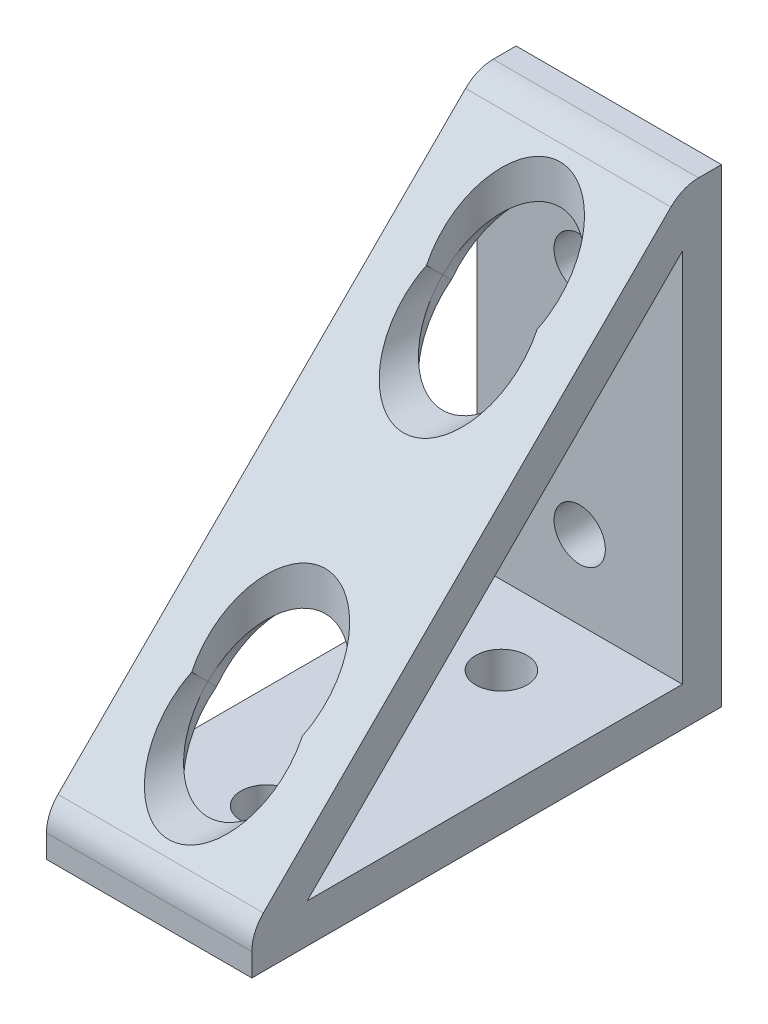
ISO-10303-21;
HEADER;
FILE_DESCRIPTION(('STEP AP214'),'2;1');
FILE_NAME('part.step','',(''),(''),'','','');
FILE_SCHEMA(('AUTOMOTIVE_DESIGN { 1 0 10303 214 1 1 1 1 }'));
ENDSEC;
DATA;
#1=APPLICATION_CONTEXT('core data for automotive mechanical design processes');
#2=APPLICATION_PROTOCOL_DEFINITION('international standard','automotive_design',2000,#1);
#3=PRODUCT_CONTEXT('',#1,'mechanical');
#4=PRODUCT('Part','Part','',(#3));
#5=PRODUCT_RELATED_PRODUCT_CATEGORY('part','',(#4));
#6=PRODUCT_DEFINITION_FORMATION('','',#4);
#7=PRODUCT_DEFINITION_CONTEXT('part definition',#1,'design');
#8=PRODUCT_DEFINITION('design','',#6,#7);
#9=PRODUCT_DEFINITION_SHAPE('','',#8);
#10=(LENGTH_UNIT() NAMED_UNIT(*) SI_UNIT(.MILLI.,.METRE.));
#11=(NAMED_UNIT(*) PLANE_ANGLE_UNIT() SI_UNIT($,.RADIAN.));
#12=(NAMED_UNIT(*) SI_UNIT($,.STERADIAN.) SOLID_ANGLE_UNIT());
#13=UNCERTAINTY_MEASURE_WITH_UNIT(LENGTH_MEASURE(1.E-05),#10,'distance_accuracy_value','');
#14=(GEOMETRIC_REPRESENTATION_CONTEXT(3) GLOBAL_UNCERTAINTY_ASSIGNED_CONTEXT((#13)) GLOBAL_UNIT_ASSIGNED_CONTEXT((#10,
#11,#12)) REPRESENTATION_CONTEXT('',''));
#15=CARTESIAN_POINT('',(0.,0.,0.));
#16=DIRECTION('',(0.,0.,1.));
#17=DIRECTION('',(1.,0.,0.));
#18=AXIS2_PLACEMENT_3D('',#15,#16,#17);
#19=CARTESIAN_POINT('',(0.,19.05,6.35));
#20=DIRECTION('',(0.,0.,1.));
#21=DIRECTION('',(0.,1.,0.));
#22=AXIS2_PLACEMENT_3D('',#19,#20,#21);
#23=CYLINDRICAL_SURFACE('',#22,9.525);
#24=CARTESIAN_POINT('',(0.,19.05,57.15));
#25=DIRECTION('',(0.,0.707106781186548,-0.707106781186548));
#26=DIRECTION('',(0.,0.707106781186548,0.707106781186548));
#27=AXIS2_PLACEMENT_3D('',#24,#25,#26);
#28=ELLIPSE('',#27,13.4703841816037,9.525);
#29=CARTESIAN_POINT('',(8.98025612106908,22.225,60.325));
#30=VERTEX_POINT('',#29);
#31=CARTESIAN_POINT('',(9.525,19.05,57.15));
#32=VERTEX_POINT('',#31);
#33=EDGE_CURVE('E321',#30,#32,#28,.T.);
#34=ORIENTED_EDGE('',*,*,#33,.T.);
#35=CARTESIAN_POINT('',(0.,19.05,57.15));
#36=DIRECTION('',(0.,-0.707106781186548,-0.707106781186548));
#37=DIRECTION('',(0.,-0.707106781186548,0.707106781186548));
#38=AXIS2_PLACEMENT_3D('',#35,#36,#37);
#39=ELLIPSE('',#38,13.4703841816037,9.525);
#40=CARTESIAN_POINT('',(-9.525,19.05,57.15));
#41=VERTEX_POINT('',#40);
#42=EDGE_CURVE('E356',#32,#41,#39,.T.);
#43=ORIENTED_EDGE('',*,*,#42,.T.);
#44=CARTESIAN_POINT('',(0.,19.05,57.15));
#45=DIRECTION('',(0.,0.707106781186548,-0.707106781186548));
#46=DIRECTION('',(0.,0.707106781186548,0.707106781186548));
#47=AXIS2_PLACEMENT_3D('',#44,#45,#46);
#48=ELLIPSE('',#47,13.4703841816037,9.525);
#49=CARTESIAN_POINT('',(-8.98025612106908,22.225,60.325));
#50=VERTEX_POINT('',#49);
#51=EDGE_CURVE('E354',#41,#50,#48,.T.);
#52=ORIENTED_EDGE('',*,*,#51,.T.);
#53=CARTESIAN_POINT('',(0.,19.05,63.5));
#54=DIRECTION('',(0.,-0.707106781186548,-0.707106781186548));
#55=DIRECTION('',(0.,-0.707106781186548,0.707106781186548));
#56=AXIS2_PLACEMENT_3D('',#53,#54,#55);
#57=ELLIPSE('',#56,13.4703841816037,9.525);
#58=EDGE_CURVE('E365',#30,#50,#57,.T.);
#59=ORIENTED_EDGE('',*,*,#58,.F.);
#60=EDGE_LOOP('',(#34,#43,#52,#59));
#61=FACE_BOUND('',#60,.T.);
#62=ADVANCED_FACE('F45',(#61),#23,.F.);
#63=CARTESIAN_POINT('',(16.6624,74.340128060535,8.2098719394654));
#64=DIRECTION('',(0.,-0.707106781186548,-0.707106781186548));
#65=DIRECTION('',(0.,0.707106781186548,-0.707106781186548));
#66=AXIS2_PLACEMENT_3D('',#63,#64,#65);
#67=PLANE('',#66);
#68=CARTESIAN_POINT('',(0.,63.5,19.05));
#69=DIRECTION('',(0.,-0.707106781186548,-0.707106781186548));
#70=DIRECTION('',(0.,0.707106781186548,-0.707106781186548));
#71=AXIS2_PLACEMENT_3D('',#68,#69,#70);
#72=ELLIPSE('',#71,13.4703841816037,9.525);
#73=CARTESIAN_POINT('',(-8.98025612106908,60.325,22.225));
#74=VERTEX_POINT('',#73);
#75=CARTESIAN_POINT('',(8.98025612106908,60.325,22.225));
#76=VERTEX_POINT('',#75);
#77=EDGE_CURVE('E466',#74,#76,#72,.T.);
#78=ORIENTED_EDGE('',*,*,#77,.T.);
#79=CARTESIAN_POINT('',(0.,57.15,25.4000000000004));
#80=DIRECTION('',(0.,-0.707106781186548,-0.707106781186548));
#81=DIRECTION('',(0.,-0.707106781186548,0.707106781186548));
#82=AXIS2_PLACEMENT_3D('',#79,#80,#81);
#83=ELLIPSE('',#82,13.4703841816037,9.525);
#84=EDGE_CURVE('E465',#76,#74,#83,.T.);
#85=ORIENTED_EDGE('',*,*,#84,.T.);
#86=EDGE_LOOP('',(#78,#85));
#87=FACE_BOUND('',#86,.T.);
#88=ORIENTED_EDGE('',*,*,#58,.T.);
#89=CARTESIAN_POINT('',(0.,25.4000000000004,57.15));
#90=DIRECTION('',(0.,-0.707106781186548,-0.707106781186548));
#91=DIRECTION('',(0.,0.707106781186548,-0.707106781186548));
#92=AXIS2_PLACEMENT_3D('',#89,#90,#91);
#93=ELLIPSE('',#92,13.4703841816037,9.525);
#94=EDGE_CURVE('E489',#50,#30,#93,.T.);
#95=ORIENTED_EDGE('',*,*,#94,.T.);
#96=EDGE_LOOP('',(#88,#95));
#97=FACE_BOUND('',#96,.T.);
#98=DIRECTION('',(0.,-0.707106781186548,0.707106781186548));
#99=VECTOR('',#98,1.);
#100=CARTESIAN_POINT('',(-16.6624,74.340128060535,8.2098719394654));
#101=LINE('',#100,#99);
#102=CARTESIAN_POINT('',(-16.6624,74.340128060535,8.2098719394654));
#103=VERTEX_POINT('',#102);
#104=CARTESIAN_POINT('',(-16.6624,8.20987193946522,74.3401280605352));
#105=VERTEX_POINT('',#104);
#106=EDGE_CURVE('E495',#103,#105,#101,.T.);
#107=ORIENTED_EDGE('',*,*,#106,.T.);
#108=DIRECTION('',(-1.,0.,0.));
#109=VECTOR('',#108,1.);
#110=CARTESIAN_POINT('',(16.6624,8.20987193946524,74.3401280605352));
#111=LINE('',#110,#109);
#112=CARTESIAN_POINT('',(16.6624,8.20987193946522,74.3401280605352));
#113=VERTEX_POINT('',#112);
#114=EDGE_CURVE('E66',#105,#113,#111,.F.);
#115=ORIENTED_EDGE('',*,*,#114,.T.);
#116=DIRECTION('',(0.,-0.707106781186548,0.707106781186548));
#117=VECTOR('',#116,1.);
#118=CARTESIAN_POINT('',(16.6624,74.340128060535,8.2098719394654));
#119=LINE('',#118,#117);
#120=CARTESIAN_POINT('',(16.6624,74.340128060535,8.2098719394654));
#121=VERTEX_POINT('',#120);
#122=EDGE_CURVE('E294',#121,#113,#119,.T.);
#123=ORIENTED_EDGE('',*,*,#122,.F.);
#124=DIRECTION('',(-1.,0.,0.));
#125=VECTOR('',#124,1.);
#126=CARTESIAN_POINT('',(16.6624,74.340128060535,8.2098719394654));
#127=LINE('',#126,#125);
#128=EDGE_CURVE('E518',#121,#103,#127,.T.);
#129=ORIENTED_EDGE('',*,*,#128,.T.);
#130=EDGE_LOOP('',(#107,#115,#123,#129));
#131=FACE_BOUND('',#130,.T.);
#132=ADVANCED_FACE('F559',(#87,#97,#131),#67,.F.);
#133=CARTESIAN_POINT('',(16.6624,3.71974387893206,69.850000000002));
#134=DIRECTION('',(1.,0.,0.));
#135=DIRECTION('',(0.,0.,-1.));
#136=AXIS2_PLACEMENT_3D('',#133,#134,#135);
#137=PLANE('',#136);
#138=DIRECTION('',(0.,0.,1.));
#139=VECTOR('',#138,1.);
#140=CARTESIAN_POINT('',(16.6624,6.35,76.2));
#141=LINE('',#140,#139);
#142=CARTESIAN_POINT('',(16.6624,6.35,6.34999999999999));
#143=VERTEX_POINT('',#142);
#144=CARTESIAN_POINT('',(16.6624,6.35,67.219743878931));
#145=VERTEX_POINT('',#144);
#146=EDGE_CURVE('E186',#143,#145,#141,.T.);
#147=ORIENTED_EDGE('',*,*,#146,.T.);
#148=DIRECTION('',(0.,-0.707106781186548,0.707106781186548));
#149=VECTOR('',#148,1.);
#150=CARTESIAN_POINT('',(16.6624,67.219743878931,6.35));
#151=LINE('',#150,#149);
#152=CARTESIAN_POINT('',(16.6624,67.219743878931,6.34999999999999));
#153=VERTEX_POINT('',#152);
#154=EDGE_CURVE('E511',#153,#145,#151,.T.);
#155=ORIENTED_EDGE('',*,*,#154,.F.);
#156=DIRECTION('',(0.,-1.,0.));
#157=VECTOR('',#156,1.);
#158=CARTESIAN_POINT('',(16.6624,6.35,6.34999999999999));
#159=LINE('',#158,#157);
#160=EDGE_CURVE('E204',#153,#143,#159,.T.);
#161=ORIENTED_EDGE('',*,*,#160,.T.);
#162=EDGE_LOOP('',(#147,#155,#161));
#163=FACE_BOUND('',#162,.T.);
#164=ORIENTED_EDGE('',*,*,#122,.T.);
#165=CARTESIAN_POINT('',(16.6624,3.71974387893206,69.850000000002));
#166=DIRECTION('',(1.,0.,0.));
#167=DIRECTION('',(0.,0.,-1.));
#168=AXIS2_PLACEMENT_3D('',#165,#166,#167);
#169=CIRCLE('',#168,6.34999999999802);
#170=CARTESIAN_POINT('',(16.6624,3.71974387893206,76.2));
#171=VERTEX_POINT('',#170);
#172=EDGE_CURVE('E53',#113,#171,#169,.T.);
#173=ORIENTED_EDGE('',*,*,#172,.T.);
#174=DIRECTION('',(0.,1.,0.));
#175=VECTOR('',#174,1.);
#176=CARTESIAN_POINT('',(16.6624,0.,76.2));
#177=LINE('',#176,#175);
#178=CARTESIAN_POINT('',(16.6624,0.,76.2));
#179=VERTEX_POINT('',#178);
#180=EDGE_CURVE('E174',#179,#171,#177,.T.);
#181=ORIENTED_EDGE('',*,*,#180,.F.);
#182=DIRECTION('',(0.,0.,1.));
#183=VECTOR('',#182,1.);
#184=CARTESIAN_POINT('',(16.6624,0.,76.2));
#185=LINE('',#184,#183);
#186=CARTESIAN_POINT('',(16.6624,0.,0.));
#187=VERTEX_POINT('',#186);
#188=EDGE_CURVE('E171',#187,#179,#185,.T.);
#189=ORIENTED_EDGE('',*,*,#188,.F.);
#190=DIRECTION('',(0.,-1.,0.));
#191=VECTOR('',#190,1.);
#192=CARTESIAN_POINT('',(16.6624,6.35,0.));
#193=LINE('',#192,#191);
#194=CARTESIAN_POINT('',(16.6624,76.2,0.));
#195=VERTEX_POINT('',#194);
#196=EDGE_CURVE('E160',#195,#187,#193,.T.);
#197=ORIENTED_EDGE('',*,*,#196,.F.);
#198=DIRECTION('',(0.,0.,1.));
#199=VECTOR('',#198,1.);
#200=CARTESIAN_POINT('',(16.6624,76.2,0.));
#201=LINE('',#200,#199);
#202=CARTESIAN_POINT('',(16.6624,76.2,3.71974387893222));
#203=VERTEX_POINT('',#202);
#204=EDGE_CURVE('E168',#195,#203,#201,.T.);
#205=ORIENTED_EDGE('',*,*,#204,.T.);
#206=CARTESIAN_POINT('',(16.6624,69.8500000000018,3.71974387893222));
#207=DIRECTION('',(1.,0.,0.));
#208=DIRECTION('',(0.,0.,-1.));
#209=AXIS2_PLACEMENT_3D('',#206,#207,#208);
#210=CIRCLE('',#209,6.34999999999802);
#211=EDGE_CURVE('E522',#203,#121,#210,.T.);
#212=ORIENTED_EDGE('',*,*,#211,.T.);
#213=EDGE_LOOP('',(#164,#173,#181,#189,#197,#205,#212));
#214=FACE_BOUND('',#213,.T.);
#215=ADVANCED_FACE('F172',(#163,#214),#137,.T.);
#216=CARTESIAN_POINT('',(16.6624,67.219743878931,6.35));
#217=DIRECTION('',(0.,-0.707106781186548,-0.707106781186548));
#218=DIRECTION('',(0.,0.707106781186548,-0.707106781186548));
#219=AXIS2_PLACEMENT_3D('',#216,#217,#218);
#220=PLANE('',#219);
#221=CARTESIAN_POINT('',(0.,16.419743878931,57.15));
#222=DIRECTION('',(0.,-0.707106781186548,-0.707106781186548));
#223=DIRECTION('',(0.,0.707106781186548,-0.707106781186548));
#224=AXIS2_PLACEMENT_3D('',#221,#222,#223);
#225=ELLIPSE('',#224,13.4703841816037,9.525);
#226=CARTESIAN_POINT('',(9.43377247893942,17.7348719394655,55.8348719394655));
#227=VERTEX_POINT('',#226);
#228=CARTESIAN_POINT('',(-9.43377247893942,17.7348719394655,55.8348719394655));
#229=VERTEX_POINT('',#228);
#230=EDGE_CURVE('E390',#227,#229,#225,.T.);
#231=ORIENTED_EDGE('',*,*,#230,.F.);
#232=CARTESIAN_POINT('',(0.,19.05,54.519743878931));
#233=DIRECTION('',(0.,-0.707106781186548,-0.707106781186548));
#234=DIRECTION('',(0.,-0.707106781186548,0.707106781186548));
#235=AXIS2_PLACEMENT_3D('',#232,#233,#234);
#236=ELLIPSE('',#235,13.4703841816037,9.525);
#237=EDGE_CURVE('E389',#229,#227,#236,.T.);
#238=ORIENTED_EDGE('',*,*,#237,.F.);
#239=EDGE_LOOP('',(#231,#238));
#240=FACE_BOUND('',#239,.T.);
#241=CARTESIAN_POINT('',(0.,57.15,16.419743878931));
#242=DIRECTION('',(0.,-0.707106781186548,-0.707106781186548));
#243=DIRECTION('',(0.,-0.707106781186548,0.707106781186548));
#244=AXIS2_PLACEMENT_3D('',#241,#242,#243);
#245=ELLIPSE('',#244,13.4703841816037,9.525);
#246=CARTESIAN_POINT('',(-9.43377247893942,55.8348719394655,17.7348719394655));
#247=VERTEX_POINT('',#246);
#248=CARTESIAN_POINT('',(9.43377247893942,55.8348719394655,17.7348719394655));
#249=VERTEX_POINT('',#248);
#250=EDGE_CURVE('E448',#247,#249,#245,.T.);
#251=ORIENTED_EDGE('',*,*,#250,.F.);
#252=CARTESIAN_POINT('',(0.,54.519743878931,19.05));
#253=DIRECTION('',(0.,-0.707106781186548,-0.707106781186548));
#254=DIRECTION('',(0.,0.707106781186548,-0.707106781186548));
#255=AXIS2_PLACEMENT_3D('',#252,#253,#254);
#256=ELLIPSE('',#255,13.4703841816037,9.525);
#257=EDGE_CURVE('E272',#249,#247,#256,.T.);
#258=ORIENTED_EDGE('',*,*,#257,.F.);
#259=EDGE_LOOP('',(#251,#258));
#260=FACE_BOUND('',#259,.T.);
#261=DIRECTION('',(0.,-0.707106781186548,0.707106781186548));
#262=VECTOR('',#261,1.);
#263=CARTESIAN_POINT('',(-16.6624,67.219743878931,6.35));
#264=LINE('',#263,#262);
#265=CARTESIAN_POINT('',(-16.6624,67.219743878931,6.34999999999999));
#266=VERTEX_POINT('',#265);
#267=CARTESIAN_POINT('',(-16.6624,6.35,67.219743878931));
#268=VERTEX_POINT('',#267);
#269=EDGE_CURVE('E270',#266,#268,#264,.T.);
#270=ORIENTED_EDGE('',*,*,#269,.F.);
#271=DIRECTION('',(-1.,0.,0.));
#272=VECTOR('',#271,1.);
#273=CARTESIAN_POINT('',(16.6624,67.219743878931,6.35));
#274=LINE('',#273,#272);
#275=EDGE_CURVE('E395',#153,#266,#274,.T.);
#276=ORIENTED_EDGE('',*,*,#275,.F.);
#277=ORIENTED_EDGE('',*,*,#154,.T.);
#278=DIRECTION('',(-1.,0.,0.));
#279=VECTOR('',#278,1.);
#280=CARTESIAN_POINT('',(16.6624,6.35,67.219743878931));
#281=LINE('',#280,#279);
#282=EDGE_CURVE('E699',#145,#268,#281,.T.);
#283=ORIENTED_EDGE('',*,*,#282,.T.);
#284=EDGE_LOOP('',(#270,#276,#277,#283));
#285=FACE_BOUND('',#284,.T.);
#286=ADVANCED_FACE('F700',(#240,#260,#285),#220,.T.);
#287=CARTESIAN_POINT('',(-16.6624,3.71974387893206,69.850000000002));
#288=DIRECTION('',(1.,0.,0.));
#289=DIRECTION('',(0.,0.,-1.));
#290=AXIS2_PLACEMENT_3D('',#287,#288,#289);
#291=PLANE('',#290);
#292=ORIENTED_EDGE('',*,*,#269,.T.);
#293=DIRECTION('',(0.,0.,-1.));
#294=VECTOR('',#293,1.);
#295=CARTESIAN_POINT('',(-16.6624,6.35,0.));
#296=LINE('',#295,#294);
#297=CARTESIAN_POINT('',(-16.6624,6.35,6.34999999999999));
#298=VERTEX_POINT('',#297);
#299=EDGE_CURVE('E183',#268,#298,#296,.T.);
#300=ORIENTED_EDGE('',*,*,#299,.T.);
#301=DIRECTION('',(0.,1.,0.));
#302=VECTOR('',#301,1.);
#303=CARTESIAN_POINT('',(-16.6624,76.2,6.34999999999999));
#304=LINE('',#303,#302);
#305=EDGE_CURVE('E209',#298,#266,#304,.T.);
#306=ORIENTED_EDGE('',*,*,#305,.T.);
#307=EDGE_LOOP('',(#292,#300,#306));
#308=FACE_BOUND('',#307,.T.);
#309=DIRECTION('',(0.,1.,0.));
#310=VECTOR('',#309,1.);
#311=CARTESIAN_POINT('',(-16.6624,0.,76.2));
#312=LINE('',#311,#310);
#313=CARTESIAN_POINT('',(-16.6624,0.,76.2));
#314=VERTEX_POINT('',#313);
#315=CARTESIAN_POINT('',(-16.6624,3.71974387893206,76.2));
#316=VERTEX_POINT('',#315);
#317=EDGE_CURVE('E194',#314,#316,#312,.T.);
#318=ORIENTED_EDGE('',*,*,#317,.T.);
#319=CARTESIAN_POINT('',(-16.6624,3.71974387893206,69.850000000002));
#320=DIRECTION('',(1.,0.,0.));
#321=DIRECTION('',(0.,0.,-1.));
#322=AXIS2_PLACEMENT_3D('',#319,#320,#321);
#323=CIRCLE('',#322,6.34999999999802);
#324=EDGE_CURVE('E517',#316,#105,#323,.F.);
#325=ORIENTED_EDGE('',*,*,#324,.T.);
#326=ORIENTED_EDGE('',*,*,#106,.F.);
#327=CARTESIAN_POINT('',(-16.6624,69.8500000000018,3.71974387893222));
#328=DIRECTION('',(1.,0.,0.));
#329=DIRECTION('',(0.,0.,-1.));
#330=AXIS2_PLACEMENT_3D('',#327,#328,#329);
#331=CIRCLE('',#330,6.34999999999802);
#332=CARTESIAN_POINT('',(-16.6624,76.2,3.71974387893222));
#333=VERTEX_POINT('',#332);
#334=EDGE_CURVE('E516',#103,#333,#331,.F.);
#335=ORIENTED_EDGE('',*,*,#334,.T.);
#336=DIRECTION('',(0.,0.,1.));
#337=VECTOR('',#336,1.);
#338=CARTESIAN_POINT('',(-16.6624,76.2,0.));
#339=LINE('',#338,#337);
#340=CARTESIAN_POINT('',(-16.6624,76.2,0.));
#341=VERTEX_POINT('',#340);
#342=EDGE_CURVE('E222',#341,#333,#339,.T.);
#343=ORIENTED_EDGE('',*,*,#342,.F.);
#344=DIRECTION('',(0.,1.,0.));
#345=VECTOR('',#344,1.);
#346=CARTESIAN_POINT('',(-16.6624,76.2,0.));
#347=LINE('',#346,#345);
#348=CARTESIAN_POINT('',(-16.6624,0.,0.));
#349=VERTEX_POINT('',#348);
#350=EDGE_CURVE('E202',#349,#341,#347,.T.);
#351=ORIENTED_EDGE('',*,*,#350,.F.);
#352=DIRECTION('',(0.,0.,-1.));
#353=VECTOR('',#352,1.);
#354=CARTESIAN_POINT('',(-16.6624,0.,0.));
#355=LINE('',#354,#353);
#356=EDGE_CURVE('E182',#314,#349,#355,.T.);
#357=ORIENTED_EDGE('',*,*,#356,.F.);
#358=EDGE_LOOP('',(#318,#325,#326,#335,#343,#351,#357));
#359=FACE_BOUND('',#358,.T.);
#360=ADVANCED_FACE('F735',(#308,#359),#291,.F.);
#361=CARTESIAN_POINT('',(0.,6.35,19.05));
#362=DIRECTION('',(0.,1.,0.));
#363=DIRECTION('',(0.,0.,-1.));
#364=AXIS2_PLACEMENT_3D('',#361,#362,#363);
#365=CYLINDRICAL_SURFACE('',#364,9.525);
#366=CARTESIAN_POINT('',(0.,57.15,19.05));
#367=DIRECTION('',(0.,0.707106781186548,-0.707106781186548));
#368=DIRECTION('',(0.,0.707106781186548,0.707106781186548));
#369=AXIS2_PLACEMENT_3D('',#366,#367,#368);
#370=ELLIPSE('',#369,13.4703841816037,9.525);
#371=CARTESIAN_POINT('',(-9.525,57.15,19.05));
#372=VERTEX_POINT('',#371);
#373=EDGE_CURVE('E418',#247,#372,#370,.T.);
#374=ORIENTED_EDGE('',*,*,#373,.T.);
#375=CARTESIAN_POINT('',(0.,57.15,19.05));
#376=DIRECTION('',(0.,0.707106781186548,0.707106781186548));
#377=DIRECTION('',(0.,0.707106781186548,-0.707106781186548));
#378=AXIS2_PLACEMENT_3D('',#375,#376,#377);
#379=ELLIPSE('',#378,13.4703841816037,9.525);
#380=CARTESIAN_POINT('',(9.525,57.15,19.05));
#381=VERTEX_POINT('',#380);
#382=EDGE_CURVE('E440',#372,#381,#379,.T.);
#383=ORIENTED_EDGE('',*,*,#382,.T.);
#384=CARTESIAN_POINT('',(0.,57.15,19.05));
#385=DIRECTION('',(0.,0.707106781186548,-0.707106781186548));
#386=DIRECTION('',(0.,0.707106781186548,0.707106781186548));
#387=AXIS2_PLACEMENT_3D('',#384,#385,#386);
#388=ELLIPSE('',#387,13.4703841816037,9.525);
#389=EDGE_CURVE('E439',#381,#249,#388,.T.);
#390=ORIENTED_EDGE('',*,*,#389,.T.);
#391=ORIENTED_EDGE('',*,*,#257,.T.);
#392=EDGE_LOOP('',(#374,#383,#390,#391));
#393=FACE_BOUND('',#392,.T.);
#394=ADVANCED_FACE('F737',(#393),#365,.F.);
#395=CARTESIAN_POINT('',(0.,57.15,6.35));
#396=DIRECTION('',(0.,0.,1.));
#397=DIRECTION('',(0.,-1.,0.));
#398=AXIS2_PLACEMENT_3D('',#395,#396,#397);
#399=CYLINDRICAL_SURFACE('',#398,9.525);
#400=ORIENTED_EDGE('',*,*,#373,.F.);
#401=ORIENTED_EDGE('',*,*,#250,.T.);
#402=ORIENTED_EDGE('',*,*,#389,.F.);
#403=CARTESIAN_POINT('',(0.,57.15,19.05));
#404=DIRECTION('',(0.,-0.707106781186548,-0.707106781186548));
#405=DIRECTION('',(0.,0.707106781186548,-0.707106781186548));
#406=AXIS2_PLACEMENT_3D('',#403,#404,#405);
#407=ELLIPSE('',#406,13.4703841816037,9.525);
#408=EDGE_CURVE('E430',#372,#381,#407,.T.);
#409=ORIENTED_EDGE('',*,*,#408,.F.);
#410=EDGE_LOOP('',(#400,#401,#402,#409));
#411=FACE_BOUND('',#410,.T.);
#412=ADVANCED_FACE('F781',(#411),#399,.F.);
#413=CARTESIAN_POINT('',(0.,6.35,19.05));
#414=DIRECTION('',(0.,1.,0.));
#415=DIRECTION('',(0.,0.,1.));
#416=AXIS2_PLACEMENT_3D('',#413,#414,#415);
#417=CYLINDRICAL_SURFACE('',#416,9.525);
#418=CARTESIAN_POINT('',(0.,57.15,19.05));
#419=DIRECTION('',(0.,-0.707106781186548,0.707106781186548));
#420=DIRECTION('',(0.,0.707106781186548,0.707106781186548));
#421=AXIS2_PLACEMENT_3D('',#418,#419,#420);
#422=ELLIPSE('',#421,13.4703841816037,9.525);
#423=EDGE_CURVE('E429',#74,#372,#422,.T.);
#424=ORIENTED_EDGE('',*,*,#423,.T.);
#425=ORIENTED_EDGE('',*,*,#408,.T.);
#426=CARTESIAN_POINT('',(0.,57.15,19.05));
#427=DIRECTION('',(0.,-0.707106781186548,0.707106781186548));
#428=DIRECTION('',(0.,0.707106781186548,0.707106781186548));
#429=AXIS2_PLACEMENT_3D('',#426,#427,#428);
#430=ELLIPSE('',#429,13.4703841816037,9.525);
#431=EDGE_CURVE('E342',#381,#76,#430,.T.);
#432=ORIENTED_EDGE('',*,*,#431,.T.);
#433=ORIENTED_EDGE('',*,*,#77,.F.);
#434=EDGE_LOOP('',(#424,#425,#432,#433));
#435=FACE_BOUND('',#434,.T.);
#436=ADVANCED_FACE('F566',(#435),#417,.F.);
#437=CARTESIAN_POINT('',(0.,57.15,6.35));
#438=DIRECTION('',(0.,0.,1.));
#439=DIRECTION('',(0.,1.,0.));
#440=AXIS2_PLACEMENT_3D('',#437,#438,#439);
#441=CYLINDRICAL_SURFACE('',#440,9.525);
#442=ORIENTED_EDGE('',*,*,#423,.F.);
#443=ORIENTED_EDGE('',*,*,#84,.F.);
#444=ORIENTED_EDGE('',*,*,#431,.F.);
#445=ORIENTED_EDGE('',*,*,#382,.F.);
#446=EDGE_LOOP('',(#442,#443,#444,#445));
#447=FACE_BOUND('',#446,.T.);
#448=ADVANCED_FACE('F572',(#447),#441,.F.);
#449=CARTESIAN_POINT('',(0.,19.05,6.35));
#450=DIRECTION('',(0.,0.,1.));
#451=DIRECTION('',(0.,-1.,0.));
#452=AXIS2_PLACEMENT_3D('',#449,#450,#451);
#453=CYLINDRICAL_SURFACE('',#452,9.525);
#454=CARTESIAN_POINT('',(0.,19.05,57.15));
#455=DIRECTION('',(0.,-0.707106781186548,0.707106781186548));
#456=DIRECTION('',(0.,0.707106781186548,0.707106781186548));
#457=AXIS2_PLACEMENT_3D('',#454,#455,#456);
#458=ELLIPSE('',#457,13.4703841816037,9.525);
#459=EDGE_CURVE('E341',#227,#32,#458,.T.);
#460=ORIENTED_EDGE('',*,*,#459,.T.);
#461=CARTESIAN_POINT('',(0.,19.05,57.15));
#462=DIRECTION('',(0.,0.707106781186548,0.707106781186548));
#463=DIRECTION('',(0.,-0.707106781186548,0.707106781186548));
#464=AXIS2_PLACEMENT_3D('',#461,#462,#463);
#465=ELLIPSE('',#464,13.4703841816037,9.525);
#466=EDGE_CURVE('E221',#32,#41,#465,.T.);
#467=ORIENTED_EDGE('',*,*,#466,.T.);
#468=CARTESIAN_POINT('',(0.,19.05,57.15));
#469=DIRECTION('',(0.,-0.707106781186548,0.707106781186548));
#470=DIRECTION('',(0.,0.707106781186548,0.707106781186548));
#471=AXIS2_PLACEMENT_3D('',#468,#469,#470);
#472=ELLIPSE('',#471,13.4703841816037,9.525);
#473=EDGE_CURVE('E217',#41,#229,#472,.T.);
#474=ORIENTED_EDGE('',*,*,#473,.T.);
#475=ORIENTED_EDGE('',*,*,#237,.T.);
#476=EDGE_LOOP('',(#460,#467,#474,#475));
#477=FACE_BOUND('',#476,.T.);
#478=ADVANCED_FACE('F612',(#477),#453,.F.);
#479=CARTESIAN_POINT('',(0.,6.35,57.15));
#480=DIRECTION('',(0.,1.,0.));
#481=DIRECTION('',(0.,0.,-1.));
#482=AXIS2_PLACEMENT_3D('',#479,#480,#481);
#483=CYLINDRICAL_SURFACE('',#482,9.525);
#484=ORIENTED_EDGE('',*,*,#459,.F.);
#485=ORIENTED_EDGE('',*,*,#230,.T.);
#486=ORIENTED_EDGE('',*,*,#473,.F.);
#487=ORIENTED_EDGE('',*,*,#42,.F.);
#488=EDGE_LOOP('',(#484,#485,#486,#487));
#489=FACE_BOUND('',#488,.T.);
#490=ADVANCED_FACE('F616',(#489),#483,.F.);
#491=CARTESIAN_POINT('',(0.,6.35,57.15));
#492=DIRECTION('',(0.,1.,0.));
#493=DIRECTION('',(0.,0.,1.));
#494=AXIS2_PLACEMENT_3D('',#491,#492,#493);
#495=CYLINDRICAL_SURFACE('',#494,9.525);
#496=ORIENTED_EDGE('',*,*,#33,.F.);
#497=ORIENTED_EDGE('',*,*,#94,.F.);
#498=ORIENTED_EDGE('',*,*,#51,.F.);
#499=ORIENTED_EDGE('',*,*,#466,.F.);
#500=EDGE_LOOP('',(#496,#497,#498,#499));
#501=FACE_BOUND('',#500,.T.);
#502=ADVANCED_FACE('F624',(#501),#495,.F.);
#503=CARTESIAN_POINT('',(16.6624,76.2,0.));
#504=DIRECTION('',(0.,-1.,0.));
#505=DIRECTION('',(0.,0.,-1.));
#506=AXIS2_PLACEMENT_3D('',#503,#504,#505);
#507=PLANE('',#506);
#508=ORIENTED_EDGE('',*,*,#342,.T.);
#509=DIRECTION('',(-1.,0.,0.));
#510=VECTOR('',#509,1.);
#511=CARTESIAN_POINT('',(16.6624,76.2,3.71974387893222));
#512=LINE('',#511,#510);
#513=EDGE_CURVE('E12',#333,#203,#512,.F.);
#514=ORIENTED_EDGE('',*,*,#513,.T.);
#515=ORIENTED_EDGE('',*,*,#204,.F.);
#516=DIRECTION('',(1.,0.,0.));
#517=VECTOR('',#516,1.);
#518=CARTESIAN_POINT('',(16.6624,76.2,0.));
#519=LINE('',#518,#517);
#520=EDGE_CURVE('E166',#341,#195,#519,.T.);
#521=ORIENTED_EDGE('',*,*,#520,.F.);
#522=EDGE_LOOP('',(#508,#514,#515,#521));
#523=FACE_BOUND('',#522,.T.);
#524=ADVANCED_FACE('F626',(#523),#507,.F.);
#525=CARTESIAN_POINT('',(0.,0.,0.));
#526=DIRECTION('',(0.,0.,1.));
#527=DIRECTION('',(1.,0.,0.));
#528=AXIS2_PLACEMENT_3D('',#525,#526,#527);
#529=PLANE('',#528);
#530=CARTESIAN_POINT('',(0.,57.15,0.));
#531=DIRECTION('',(0.,0.,1.));
#532=DIRECTION('',(1.,0.,0.));
#533=AXIS2_PLACEMENT_3D('',#530,#531,#532);
#534=CIRCLE('',#533,4.16560000000001);
#535=CARTESIAN_POINT('',(4.16560000000001,57.15,0.));
#536=VERTEX_POINT('',#535);
#537=EDGE_CURVE('E762',#536,#536,#534,.T.);
#538=ORIENTED_EDGE('',*,*,#537,.T.);
#539=EDGE_LOOP('',(#538));
#540=FACE_BOUND('',#539,.T.);
#541=CARTESIAN_POINT('',(0.,19.05,0.));
#542=DIRECTION('',(0.,0.,1.));
#543=DIRECTION('',(1.,0.,0.));
#544=AXIS2_PLACEMENT_3D('',#541,#542,#543);
#545=CIRCLE('',#544,4.16560000000001);
#546=CARTESIAN_POINT('',(4.16560000000001,19.05,0.));
#547=VERTEX_POINT('',#546);
#548=EDGE_CURVE('E201',#547,#547,#545,.T.);
#549=ORIENTED_EDGE('',*,*,#548,.T.);
#550=EDGE_LOOP('',(#549));
#551=FACE_BOUND('',#550,.T.);
#552=ORIENTED_EDGE('',*,*,#196,.T.);
#553=DIRECTION('',(1.,0.,0.));
#554=VECTOR('',#553,1.);
#555=CARTESIAN_POINT('',(16.6624,0.,0.));
#556=LINE('',#555,#554);
#557=EDGE_CURVE('E164',#349,#187,#556,.T.);
#558=ORIENTED_EDGE('',*,*,#557,.F.);
#559=ORIENTED_EDGE('',*,*,#350,.T.);
#560=ORIENTED_EDGE('',*,*,#520,.T.);
#561=EDGE_LOOP('',(#552,#558,#559,#560));
#562=FACE_BOUND('',#561,.T.);
#563=ADVANCED_FACE('F162',(#540,#551,#562),#529,.F.);
#564=CARTESIAN_POINT('',(0.,0.,6.34999999999999));
#565=DIRECTION('',(0.,0.,1.));
#566=DIRECTION('',(1.,0.,0.));
#567=AXIS2_PLACEMENT_3D('',#564,#565,#566);
#568=PLANE('',#567);
#569=CARTESIAN_POINT('',(0.,57.15,6.35));
#570=DIRECTION('',(0.,0.,1.));
#571=DIRECTION('',(1.,0.,0.));
#572=AXIS2_PLACEMENT_3D('',#569,#570,#571);
#573=CIRCLE('',#572,4.16560000000001);
#574=CARTESIAN_POINT('',(4.16560000000001,57.15,6.35));
#575=VERTEX_POINT('',#574);
#576=EDGE_CURVE('E687',#575,#575,#573,.T.);
#577=ORIENTED_EDGE('',*,*,#576,.F.);
#578=EDGE_LOOP('',(#577));
#579=FACE_BOUND('',#578,.T.);
#580=CARTESIAN_POINT('',(0.,19.05,6.35));
#581=DIRECTION('',(0.,0.,1.));
#582=DIRECTION('',(1.,0.,0.));
#583=AXIS2_PLACEMENT_3D('',#580,#581,#582);
#584=CIRCLE('',#583,4.16560000000001);
#585=CARTESIAN_POINT('',(4.16560000000001,19.05,6.35));
#586=VERTEX_POINT('',#585);
#587=EDGE_CURVE('E189',#586,#586,#584,.T.);
#588=ORIENTED_EDGE('',*,*,#587,.F.);
#589=EDGE_LOOP('',(#588));
#590=FACE_BOUND('',#589,.T.);
#591=ORIENTED_EDGE('',*,*,#160,.F.);
#592=ORIENTED_EDGE('',*,*,#275,.T.);
#593=ORIENTED_EDGE('',*,*,#305,.F.);
#594=DIRECTION('',(-1.,0.,0.));
#595=VECTOR('',#594,1.);
#596=CARTESIAN_POINT('',(-16.6624,6.35,6.34999999999999));
#597=LINE('',#596,#595);
#598=EDGE_CURVE('E206',#143,#298,#597,.T.);
#599=ORIENTED_EDGE('',*,*,#598,.F.);
#600=EDGE_LOOP('',(#591,#592,#593,#599));
#601=FACE_BOUND('',#600,.T.);
#602=ADVANCED_FACE('F676',(#579,#590,#601),#568,.T.);
#603=CARTESIAN_POINT('',(-16.6624,0.,76.2));
#604=DIRECTION('',(0.,0.,-1.));
#605=DIRECTION('',(-1.,0.,0.));
#606=AXIS2_PLACEMENT_3D('',#603,#604,#605);
#607=PLANE('',#606);
#608=ORIENTED_EDGE('',*,*,#180,.T.);
#609=DIRECTION('',(-1.,0.,0.));
#610=VECTOR('',#609,1.);
#611=CARTESIAN_POINT('',(-16.6624,3.71974387893206,76.2));
#612=LINE('',#611,#610);
#613=EDGE_CURVE('E514',#171,#316,#612,.T.);
#614=ORIENTED_EDGE('',*,*,#613,.T.);
#615=ORIENTED_EDGE('',*,*,#317,.F.);
#616=DIRECTION('',(-1.,0.,0.));
#617=VECTOR('',#616,1.);
#618=CARTESIAN_POINT('',(-16.6624,0.,76.2));
#619=LINE('',#618,#617);
#620=EDGE_CURVE('E177',#179,#314,#619,.T.);
#621=ORIENTED_EDGE('',*,*,#620,.F.);
#622=EDGE_LOOP('',(#608,#614,#615,#621));
#623=FACE_BOUND('',#622,.T.);
#624=ADVANCED_FACE('F530',(#623),#607,.F.);
#625=CARTESIAN_POINT('',(0.,0.,0.));
#626=DIRECTION('',(0.,1.,0.));
#627=DIRECTION('',(0.,0.,1.));
#628=AXIS2_PLACEMENT_3D('',#625,#626,#627);
#629=PLANE('',#628);
#630=CARTESIAN_POINT('',(0.,0.,57.15));
#631=DIRECTION('',(0.,1.,0.));
#632=DIRECTION('',(0.,0.,1.));
#633=AXIS2_PLACEMENT_3D('',#630,#631,#632);
#634=CIRCLE('',#633,4.16560000000001);
#635=CARTESIAN_POINT('',(0.,0.,61.3156));
#636=VERTEX_POINT('',#635);
#637=EDGE_CURVE('E753',#636,#636,#634,.T.);
#638=ORIENTED_EDGE('',*,*,#637,.T.);
#639=EDGE_LOOP('',(#638));
#640=FACE_BOUND('',#639,.T.);
#641=CARTESIAN_POINT('',(0.,0.,19.05));
#642=DIRECTION('',(0.,1.,0.));
#643=DIRECTION('',(0.,0.,1.));
#644=AXIS2_PLACEMENT_3D('',#641,#642,#643);
#645=CIRCLE('',#644,4.16560000000001);
#646=CARTESIAN_POINT('',(0.,0.,23.2156));
#647=VERTEX_POINT('',#646);
#648=EDGE_CURVE('E750',#647,#647,#645,.T.);
#649=ORIENTED_EDGE('',*,*,#648,.T.);
#650=EDGE_LOOP('',(#649));
#651=FACE_BOUND('',#650,.T.);
#652=ORIENTED_EDGE('',*,*,#557,.T.);
#653=ORIENTED_EDGE('',*,*,#188,.T.);
#654=ORIENTED_EDGE('',*,*,#620,.T.);
#655=ORIENTED_EDGE('',*,*,#356,.T.);
#656=EDGE_LOOP('',(#652,#653,#654,#655));
#657=FACE_BOUND('',#656,.T.);
#658=ADVANCED_FACE('F180',(#640,#651,#657),#629,.F.);
#659=CARTESIAN_POINT('',(0.,6.35,0.));
#660=DIRECTION('',(0.,1.,0.));
#661=DIRECTION('',(0.,0.,1.));
#662=AXIS2_PLACEMENT_3D('',#659,#660,#661);
#663=PLANE('',#662);
#664=CARTESIAN_POINT('',(0.,6.35,57.15));
#665=DIRECTION('',(0.,1.,0.));
#666=DIRECTION('',(0.,0.,1.));
#667=AXIS2_PLACEMENT_3D('',#664,#665,#666);
#668=CIRCLE('',#667,4.16560000000001);
#669=CARTESIAN_POINT('',(0.,6.35,61.3156));
#670=VERTEX_POINT('',#669);
#671=EDGE_CURVE('E755',#670,#670,#668,.T.);
#672=ORIENTED_EDGE('',*,*,#671,.F.);
#673=EDGE_LOOP('',(#672));
#674=FACE_BOUND('',#673,.T.);
#675=CARTESIAN_POINT('',(0.,6.35,19.05));
#676=DIRECTION('',(0.,1.,0.));
#677=DIRECTION('',(0.,0.,1.));
#678=AXIS2_PLACEMENT_3D('',#675,#676,#677);
#679=CIRCLE('',#678,4.16560000000001);
#680=CARTESIAN_POINT('',(0.,6.35,23.2156));
#681=VERTEX_POINT('',#680);
#682=EDGE_CURVE('E752',#681,#681,#679,.T.);
#683=ORIENTED_EDGE('',*,*,#682,.F.);
#684=EDGE_LOOP('',(#683));
#685=FACE_BOUND('',#684,.T.);
#686=ORIENTED_EDGE('',*,*,#299,.F.);
#687=ORIENTED_EDGE('',*,*,#282,.F.);
#688=ORIENTED_EDGE('',*,*,#146,.F.);
#689=ORIENTED_EDGE('',*,*,#598,.T.);
#690=EDGE_LOOP('',(#686,#687,#688,#689));
#691=FACE_BOUND('',#690,.T.);
#692=ADVANCED_FACE('F666',(#674,#685,#691),#663,.T.);
#693=CARTESIAN_POINT('',(0.,19.05,6.34999999999999));
#694=DIRECTION('',(0.,0.,1.));
#695=DIRECTION('',(1.,0.,0.));
#696=AXIS2_PLACEMENT_3D('',#693,#694,#695);
#697=CYLINDRICAL_SURFACE('',#696,4.16560000000001);
#698=ORIENTED_EDGE('',*,*,#587,.T.);
#699=EDGE_LOOP('',(#698));
#700=FACE_BOUND('',#699,.T.);
#701=ORIENTED_EDGE('',*,*,#548,.F.);
#702=EDGE_LOOP('',(#701));
#703=FACE_BOUND('',#702,.T.);
#704=ADVANCED_FACE('F662',(#700,#703),#697,.F.);
#705=CARTESIAN_POINT('',(0.,57.15,6.34999999999999));
#706=DIRECTION('',(0.,0.,1.));
#707=DIRECTION('',(1.,0.,0.));
#708=AXIS2_PLACEMENT_3D('',#705,#706,#707);
#709=CYLINDRICAL_SURFACE('',#708,4.16560000000001);
#710=ORIENTED_EDGE('',*,*,#576,.T.);
#711=EDGE_LOOP('',(#710));
#712=FACE_BOUND('',#711,.T.);
#713=ORIENTED_EDGE('',*,*,#537,.F.);
#714=EDGE_LOOP('',(#713));
#715=FACE_BOUND('',#714,.T.);
#716=ADVANCED_FACE('F654',(#712,#715),#709,.F.);
#717=CARTESIAN_POINT('',(0.,6.35,19.05));
#718=DIRECTION('',(0.,1.,0.));
#719=DIRECTION('',(0.,0.,1.));
#720=AXIS2_PLACEMENT_3D('',#717,#718,#719);
#721=CYLINDRICAL_SURFACE('',#720,4.16560000000001);
#722=ORIENTED_EDGE('',*,*,#682,.T.);
#723=EDGE_LOOP('',(#722));
#724=FACE_BOUND('',#723,.T.);
#725=ORIENTED_EDGE('',*,*,#648,.F.);
#726=EDGE_LOOP('',(#725));
#727=FACE_BOUND('',#726,.T.);
#728=ADVANCED_FACE('F648',(#724,#727),#721,.F.);
#729=CARTESIAN_POINT('',(0.,6.35,57.15));
#730=DIRECTION('',(0.,1.,0.));
#731=DIRECTION('',(0.,0.,1.));
#732=AXIS2_PLACEMENT_3D('',#729,#730,#731);
#733=CYLINDRICAL_SURFACE('',#732,4.16560000000001);
#734=ORIENTED_EDGE('',*,*,#671,.T.);
#735=EDGE_LOOP('',(#734));
#736=FACE_BOUND('',#735,.T.);
#737=ORIENTED_EDGE('',*,*,#637,.F.);
#738=EDGE_LOOP('',(#737));
#739=FACE_BOUND('',#738,.T.);
#740=ADVANCED_FACE('F642',(#736,#739),#733,.F.);
#741=CARTESIAN_POINT('',(-16.6624,3.71974387893206,69.850000000002));
#742=DIRECTION('',(-1.,0.,0.));
#743=DIRECTION('',(0.,0.,1.));
#744=AXIS2_PLACEMENT_3D('',#741,#742,#743);
#745=CYLINDRICAL_SURFACE('',#744,6.34999999999802);
#746=ORIENTED_EDGE('',*,*,#172,.F.);
#747=ORIENTED_EDGE('',*,*,#114,.F.);
#748=ORIENTED_EDGE('',*,*,#324,.F.);
#749=ORIENTED_EDGE('',*,*,#613,.F.);
#750=EDGE_LOOP('',(#746,#747,#748,#749));
#751=FACE_BOUND('',#750,.T.);
#752=ADVANCED_FACE('F533',(#751),#745,.T.);
#753=CARTESIAN_POINT('',(16.6624,69.8500000000018,3.71974387893222));
#754=DIRECTION('',(-1.,0.,0.));
#755=DIRECTION('',(0.,0.,1.));
#756=AXIS2_PLACEMENT_3D('',#753,#754,#755);
#757=CYLINDRICAL_SURFACE('',#756,6.34999999999802);
#758=ORIENTED_EDGE('',*,*,#211,.F.);
#759=ORIENTED_EDGE('',*,*,#513,.F.);
#760=ORIENTED_EDGE('',*,*,#334,.F.);
#761=ORIENTED_EDGE('',*,*,#128,.F.);
#762=EDGE_LOOP('',(#758,#759,#760,#761));
#763=FACE_BOUND('',#762,.T.);
#764=ADVANCED_FACE('F47',(#763),#757,.T.);
#765=CLOSED_SHELL('',(#62,#132,#215,#286,#360,#394,#412,#436,#448,#478,#490,#502,#524,#563,#602,
#624,#658,#692,#704,#716,#728,#740,#752,#764));
#766=MANIFOLD_SOLID_BREP('B2',#765);
#767=ADVANCED_BREP_SHAPE_REPRESENTATION('',(#18,#766),#14);
#768=SHAPE_DEFINITION_REPRESENTATION(#9,#767);
ENDSEC;
END-ISO-10303-21;
